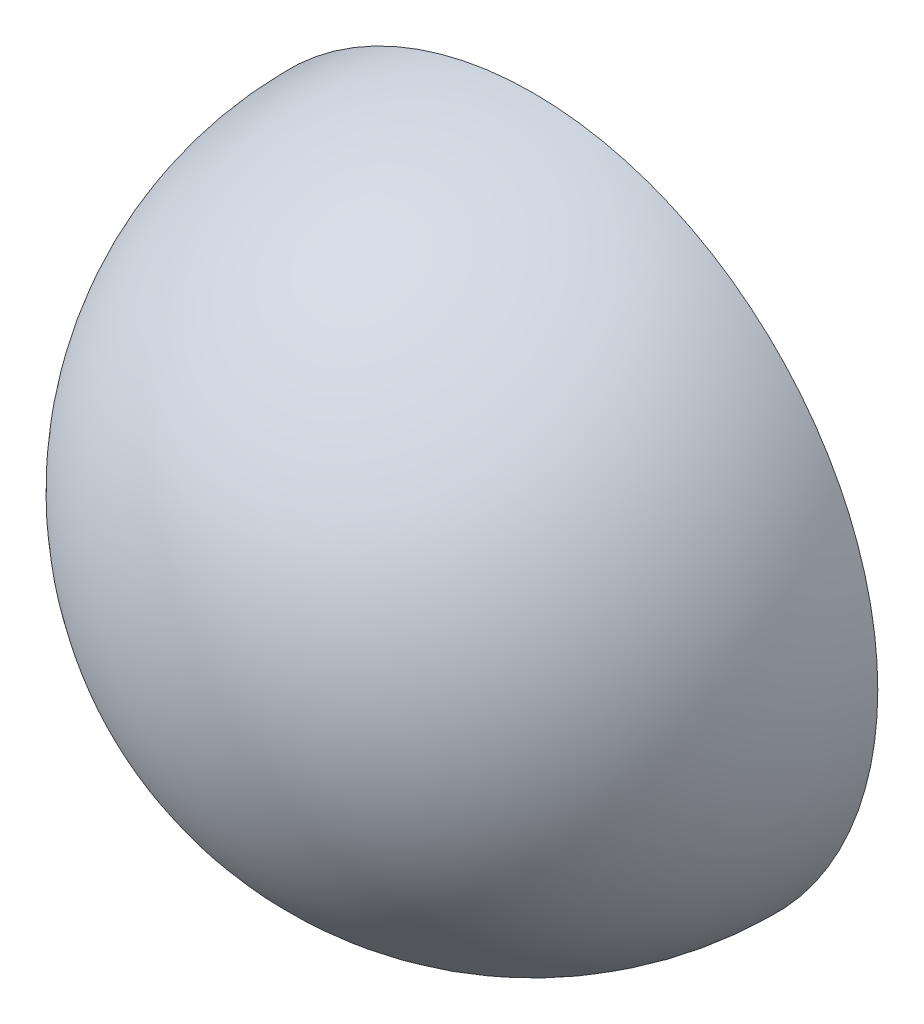
ISO-10303-21;
HEADER;
FILE_DESCRIPTION(('STEP AP214'),'2;1');
FILE_NAME('part.step','',(''),(''),'','','');
FILE_SCHEMA(('AUTOMOTIVE_DESIGN { 1 0 10303 214 1 1 1 1 }'));
ENDSEC;
DATA;
#1=APPLICATION_CONTEXT('core data for automotive mechanical design processes');
#2=APPLICATION_PROTOCOL_DEFINITION('international standard','automotive_design',2000,#1);
#3=PRODUCT_CONTEXT('',#1,'mechanical');
#4=PRODUCT('Part','Part','',(#3));
#5=PRODUCT_RELATED_PRODUCT_CATEGORY('part','',(#4));
#6=PRODUCT_DEFINITION_FORMATION('','',#4);
#7=PRODUCT_DEFINITION_CONTEXT('part definition',#1,'design');
#8=PRODUCT_DEFINITION('design','',#6,#7);
#9=PRODUCT_DEFINITION_SHAPE('','',#8);
#10=(LENGTH_UNIT() NAMED_UNIT(*) SI_UNIT(.MILLI.,.METRE.));
#11=(NAMED_UNIT(*) PLANE_ANGLE_UNIT() SI_UNIT($,.RADIAN.));
#12=(NAMED_UNIT(*) SI_UNIT($,.STERADIAN.) SOLID_ANGLE_UNIT());
#13=UNCERTAINTY_MEASURE_WITH_UNIT(LENGTH_MEASURE(1.E-05),#10,'distance_accuracy_value','');
#14=(GEOMETRIC_REPRESENTATION_CONTEXT(3) GLOBAL_UNCERTAINTY_ASSIGNED_CONTEXT((#13)) GLOBAL_UNIT_ASSIGNED_CONTEXT((#10,
#11,#12)) REPRESENTATION_CONTEXT('',''));
#15=CARTESIAN_POINT('',(0.,0.,0.));
#16=DIRECTION('',(0.,0.,1.));
#17=DIRECTION('',(1.,0.,0.));
#18=AXIS2_PLACEMENT_3D('',#15,#16,#17);
#19=CARTESIAN_POINT('',(-1.25,0.,0.));
#20=DIRECTION('',(0.,0.,1.));
#21=DIRECTION('',(1.,0.,0.));
#22=AXIS2_PLACEMENT_3D('',#19,#20,#21);
#23=PLANE('',#22);
#24=CARTESIAN_POINT('',(0.,0.,0.));
#25=DIRECTION('',(0.,0.,1.));
#26=DIRECTION('',(1.,0.,0.));
#27=AXIS2_PLACEMENT_3D('',#24,#25,#26);
#28=CIRCLE('',#27,1.25);
#29=CARTESIAN_POINT('',(1.25,0.,0.));
#30=VERTEX_POINT('',#29);
#31=EDGE_CURVE('E10',#30,#30,#28,.T.);
#32=ORIENTED_EDGE('',*,*,#31,.F.);
#33=EDGE_LOOP('',(#32));
#34=FACE_BOUND('',#33,.T.);
#35=ADVANCED_FACE('F33',(#34),#23,.F.);
#36=CARTESIAN_POINT('',(0.,0.,0.));
#37=DIRECTION('',(0.,0.,1.));
#38=DIRECTION('',(-1.,0.,0.));
#39=AXIS2_PLACEMENT_3D('',#36,#37,#38);
#40=SPHERICAL_SURFACE('',#39,1.25);
#41=ORIENTED_EDGE('',*,*,#31,.T.);
#42=EDGE_LOOP('',(#41));
#43=FACE_BOUND('',#42,.T.);
#44=ADVANCED_FACE('F40',(#43),#40,.T.);
#45=CLOSED_SHELL('',(#35,#44));
#46=MANIFOLD_SOLID_BREP('B2',#45);
#47=ADVANCED_BREP_SHAPE_REPRESENTATION('',(#18,#46),#14);
#48=SHAPE_DEFINITION_REPRESENTATION(#9,#47);
ENDSEC;
END-ISO-10303-21;
